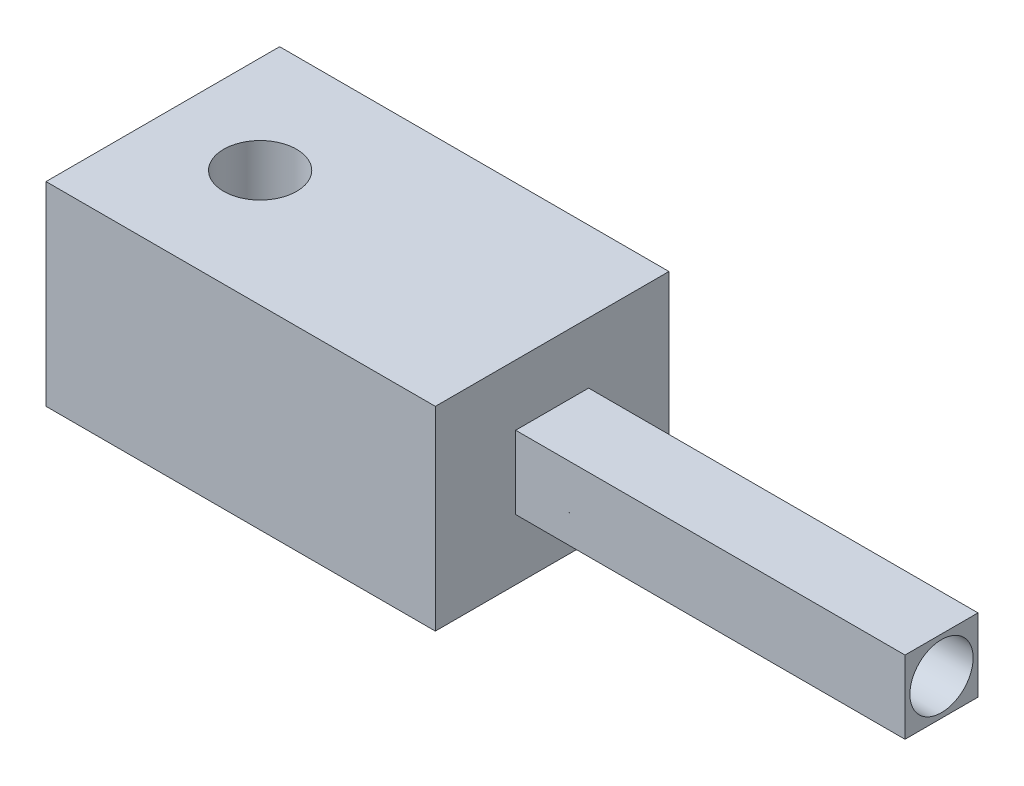
ISO-10303-21;
HEADER;
FILE_DESCRIPTION(('STEP AP214'),'2;1');
FILE_NAME('part.step','',(''),(''),'','','');
FILE_SCHEMA(('AUTOMOTIVE_DESIGN { 1 0 10303 214 1 1 1 1 }'));
ENDSEC;
DATA;
#1=APPLICATION_CONTEXT('core data for automotive mechanical design processes');
#2=APPLICATION_PROTOCOL_DEFINITION('international standard','automotive_design',2000,#1);
#3=PRODUCT_CONTEXT('',#1,'mechanical');
#4=PRODUCT('Part','Part','',(#3));
#5=PRODUCT_RELATED_PRODUCT_CATEGORY('part','',(#4));
#6=PRODUCT_DEFINITION_FORMATION('','',#4);
#7=PRODUCT_DEFINITION_CONTEXT('part definition',#1,'design');
#8=PRODUCT_DEFINITION('design','',#6,#7);
#9=PRODUCT_DEFINITION_SHAPE('','',#8);
#10=(LENGTH_UNIT() NAMED_UNIT(*) SI_UNIT(.MILLI.,.METRE.));
#11=(NAMED_UNIT(*) PLANE_ANGLE_UNIT() SI_UNIT($,.RADIAN.));
#12=(NAMED_UNIT(*) SI_UNIT($,.STERADIAN.) SOLID_ANGLE_UNIT());
#13=UNCERTAINTY_MEASURE_WITH_UNIT(LENGTH_MEASURE(1.E-05),#10,'distance_accuracy_value','');
#14=(GEOMETRIC_REPRESENTATION_CONTEXT(3) GLOBAL_UNCERTAINTY_ASSIGNED_CONTEXT((#13)) GLOBAL_UNIT_ASSIGNED_CONTEXT((#10,
#11,#12)) REPRESENTATION_CONTEXT('',''));
#15=CARTESIAN_POINT('',(0.,0.,0.));
#16=DIRECTION('',(0.,0.,1.));
#17=DIRECTION('',(1.,0.,0.));
#18=AXIS2_PLACEMENT_3D('',#15,#16,#17);
#19=CARTESIAN_POINT('',(40.,3.75,-3.75));
#20=DIRECTION('',(0.,0.,1.));
#21=DIRECTION('',(1.,0.,0.));
#22=AXIS2_PLACEMENT_3D('',#19,#20,#21);
#23=PLANE('',#22);
#24=DIRECTION('',(0.,1.,0.));
#25=VECTOR('',#24,1.);
#26=CARTESIAN_POINT('',(0.,3.75,-3.75));
#27=LINE('',#26,#25);
#28=CARTESIAN_POINT('',(0.,-3.75,-3.75));
#29=VERTEX_POINT('',#28);
#30=CARTESIAN_POINT('',(0.,3.75,-3.75));
#31=VERTEX_POINT('',#30);
#32=EDGE_CURVE('E132',#29,#31,#27,.T.);
#33=ORIENTED_EDGE('',*,*,#32,.T.);
#34=DIRECTION('',(-1.,0.,0.));
#35=VECTOR('',#34,1.);
#36=CARTESIAN_POINT('',(40.,3.75,-3.75));
#37=LINE('',#36,#35);
#38=CARTESIAN_POINT('',(40.,3.75,-3.75));
#39=VERTEX_POINT('',#38);
#40=EDGE_CURVE('E11',#39,#31,#37,.T.);
#41=ORIENTED_EDGE('',*,*,#40,.F.);
#42=DIRECTION('',(0.,1.,0.));
#43=VECTOR('',#42,1.);
#44=CARTESIAN_POINT('',(40.,3.75,-3.75));
#45=LINE('',#44,#43);
#46=CARTESIAN_POINT('',(40.,-3.75,-3.75));
#47=VERTEX_POINT('',#46);
#48=EDGE_CURVE('E143',#47,#39,#45,.T.);
#49=ORIENTED_EDGE('',*,*,#48,.F.);
#50=DIRECTION('',(-1.,0.,0.));
#51=VECTOR('',#50,1.);
#52=CARTESIAN_POINT('',(40.,-3.75,-3.75));
#53=LINE('',#52,#51);
#54=EDGE_CURVE('E154',#47,#29,#53,.T.);
#55=ORIENTED_EDGE('',*,*,#54,.T.);
#56=EDGE_LOOP('',(#33,#41,#49,#55));
#57=FACE_BOUND('',#56,.T.);
#58=ADVANCED_FACE('F43',(#57),#23,.F.);
#59=CARTESIAN_POINT('',(40.,3.75,3.75));
#60=DIRECTION('',(0.,-1.,0.));
#61=DIRECTION('',(0.,0.,-1.));
#62=AXIS2_PLACEMENT_3D('',#59,#60,#61);
#63=PLANE('',#62);
#64=DIRECTION('',(0.,0.,1.));
#65=VECTOR('',#64,1.);
#66=CARTESIAN_POINT('',(0.,3.75,3.75));
#67=LINE('',#66,#65);
#68=CARTESIAN_POINT('',(0.,3.75,3.75));
#69=VERTEX_POINT('',#68);
#70=EDGE_CURVE('E137',#31,#69,#67,.T.);
#71=ORIENTED_EDGE('',*,*,#70,.T.);
#72=DIRECTION('',(-1.,0.,0.));
#73=VECTOR('',#72,1.);
#74=CARTESIAN_POINT('',(40.,3.75,3.75));
#75=LINE('',#74,#73);
#76=CARTESIAN_POINT('',(40.,3.75,3.75));
#77=VERTEX_POINT('',#76);
#78=EDGE_CURVE('E52',#77,#69,#75,.T.);
#79=ORIENTED_EDGE('',*,*,#78,.F.);
#80=DIRECTION('',(0.,0.,1.));
#81=VECTOR('',#80,1.);
#82=CARTESIAN_POINT('',(40.,3.75,3.75));
#83=LINE('',#82,#81);
#84=EDGE_CURVE('E146',#39,#77,#83,.T.);
#85=ORIENTED_EDGE('',*,*,#84,.F.);
#86=ORIENTED_EDGE('',*,*,#40,.T.);
#87=EDGE_LOOP('',(#71,#79,#85,#86));
#88=FACE_BOUND('',#87,.T.);
#89=ADVANCED_FACE('F181',(#88),#63,.F.);
#90=CARTESIAN_POINT('',(40.,3.75,3.75));
#91=DIRECTION('',(0.,0.,-1.));
#92=DIRECTION('',(0.,1.,0.));
#93=AXIS2_PLACEMENT_3D('',#90,#91,#92);
#94=PLANE('',#93);
#95=DIRECTION('',(0.,-1.,0.));
#96=VECTOR('',#95,1.);
#97=CARTESIAN_POINT('',(0.,3.75,3.75));
#98=LINE('',#97,#96);
#99=CARTESIAN_POINT('',(0.,-3.75,3.75));
#100=VERTEX_POINT('',#99);
#101=EDGE_CURVE('E159',#69,#100,#98,.T.);
#102=ORIENTED_EDGE('',*,*,#101,.T.);
#103=DIRECTION('',(-1.,0.,0.));
#104=VECTOR('',#103,1.);
#105=CARTESIAN_POINT('',(40.,-3.75,3.75));
#106=LINE('',#105,#104);
#107=CARTESIAN_POINT('',(40.,-3.75,3.75));
#108=VERTEX_POINT('',#107);
#109=EDGE_CURVE('E169',#108,#100,#106,.T.);
#110=ORIENTED_EDGE('',*,*,#109,.F.);
#111=DIRECTION('',(0.,-1.,0.));
#112=VECTOR('',#111,1.);
#113=CARTESIAN_POINT('',(40.,3.75,3.75));
#114=LINE('',#113,#112);
#115=EDGE_CURVE('E150',#77,#108,#114,.T.);
#116=ORIENTED_EDGE('',*,*,#115,.F.);
#117=ORIENTED_EDGE('',*,*,#78,.T.);
#118=EDGE_LOOP('',(#102,#110,#116,#117));
#119=FACE_BOUND('',#118,.T.);
#120=ADVANCED_FACE('F177',(#119),#94,.F.);
#121=CARTESIAN_POINT('',(40.,-3.75,3.75));
#122=DIRECTION('',(0.,1.,0.));
#123=DIRECTION('',(0.,0.,1.));
#124=AXIS2_PLACEMENT_3D('',#121,#122,#123);
#125=PLANE('',#124);
#126=DIRECTION('',(0.,0.,-1.));
#127=VECTOR('',#126,1.);
#128=CARTESIAN_POINT('',(0.,-3.75,3.75));
#129=LINE('',#128,#127);
#130=EDGE_CURVE('E147',#100,#29,#129,.T.);
#131=ORIENTED_EDGE('',*,*,#130,.T.);
#132=ORIENTED_EDGE('',*,*,#54,.F.);
#133=DIRECTION('',(0.,0.,-1.));
#134=VECTOR('',#133,1.);
#135=CARTESIAN_POINT('',(40.,-3.75,3.75));
#136=LINE('',#135,#134);
#137=EDGE_CURVE('E59',#108,#47,#136,.T.);
#138=ORIENTED_EDGE('',*,*,#137,.F.);
#139=ORIENTED_EDGE('',*,*,#109,.T.);
#140=EDGE_LOOP('',(#131,#132,#138,#139));
#141=FACE_BOUND('',#140,.T.);
#142=ADVANCED_FACE('F187',(#141),#125,.F.);
#143=CARTESIAN_POINT('',(40.,0.,0.));
#144=DIRECTION('',(1.,0.,0.));
#145=DIRECTION('',(0.,0.,-1.));
#146=AXIS2_PLACEMENT_3D('',#143,#144,#145);
#147=PLANE('',#146);
#148=CARTESIAN_POINT('',(40.,0.,0.));
#149=DIRECTION('',(1.,0.,0.));
#150=DIRECTION('',(0.,0.,-1.));
#151=AXIS2_PLACEMENT_3D('',#148,#149,#150);
#152=CIRCLE('',#151,3.25);
#153=CARTESIAN_POINT('',(40.,0.,-3.25));
#154=VERTEX_POINT('',#153);
#155=EDGE_CURVE('E344',#154,#154,#152,.T.);
#156=ORIENTED_EDGE('',*,*,#155,.F.);
#157=EDGE_LOOP('',(#156));
#158=FACE_BOUND('',#157,.T.);
#159=ORIENTED_EDGE('',*,*,#48,.T.);
#160=ORIENTED_EDGE('',*,*,#84,.T.);
#161=ORIENTED_EDGE('',*,*,#115,.T.);
#162=ORIENTED_EDGE('',*,*,#137,.T.);
#163=EDGE_LOOP('',(#159,#160,#161,#162));
#164=FACE_BOUND('',#163,.T.);
#165=ADVANCED_FACE('F190',(#158,#164),#147,.T.);
#166=CARTESIAN_POINT('',(-40.,10.,12.));
#167=DIRECTION('',(0.,0.,-1.));
#168=DIRECTION('',(-1.,0.,0.));
#169=AXIS2_PLACEMENT_3D('',#166,#167,#168);
#170=PLANE('',#169);
#171=DIRECTION('',(0.,1.,0.));
#172=VECTOR('',#171,1.);
#173=CARTESIAN_POINT('',(0.,10.,12.));
#174=LINE('',#173,#172);
#175=CARTESIAN_POINT('',(0.,-10.,12.));
#176=VERTEX_POINT('',#175);
#177=CARTESIAN_POINT('',(0.,10.,12.));
#178=VERTEX_POINT('',#177);
#179=EDGE_CURVE('E130',#176,#178,#174,.T.);
#180=ORIENTED_EDGE('',*,*,#179,.T.);
#181=DIRECTION('',(1.,0.,0.));
#182=VECTOR('',#181,1.);
#183=CARTESIAN_POINT('',(-40.,10.,12.));
#184=LINE('',#183,#182);
#185=CARTESIAN_POINT('',(-40.,10.,12.));
#186=VERTEX_POINT('',#185);
#187=EDGE_CURVE('E108',#186,#178,#184,.T.);
#188=ORIENTED_EDGE('',*,*,#187,.F.);
#189=DIRECTION('',(0.,1.,0.));
#190=VECTOR('',#189,1.);
#191=CARTESIAN_POINT('',(-40.,10.,12.));
#192=LINE('',#191,#190);
#193=CARTESIAN_POINT('',(-40.,-10.,12.));
#194=VERTEX_POINT('',#193);
#195=EDGE_CURVE('E116',#194,#186,#192,.T.);
#196=ORIENTED_EDGE('',*,*,#195,.F.);
#197=DIRECTION('',(1.,0.,0.));
#198=VECTOR('',#197,1.);
#199=CARTESIAN_POINT('',(-40.,-10.,12.));
#200=LINE('',#199,#198);
#201=EDGE_CURVE('E365',#194,#176,#200,.T.);
#202=ORIENTED_EDGE('',*,*,#201,.T.);
#203=EDGE_LOOP('',(#180,#188,#196,#202));
#204=FACE_BOUND('',#203,.T.);
#205=ADVANCED_FACE('F128',(#204),#170,.F.);
#206=CARTESIAN_POINT('',(-40.,10.,-12.));
#207=DIRECTION('',(0.,-1.,0.));
#208=DIRECTION('',(0.,0.,-1.));
#209=AXIS2_PLACEMENT_3D('',#206,#207,#208);
#210=PLANE('',#209);
#211=CARTESIAN_POINT('',(-30.,10.,0.));
#212=DIRECTION('',(0.,1.,0.));
#213=DIRECTION('',(0.,0.,1.));
#214=AXIS2_PLACEMENT_3D('',#211,#212,#213);
#215=CIRCLE('',#214,3.75);
#216=CARTESIAN_POINT('',(-30.,10.,3.75));
#217=VERTEX_POINT('',#216);
#218=EDGE_CURVE('E349',#217,#217,#215,.T.);
#219=ORIENTED_EDGE('',*,*,#218,.F.);
#220=EDGE_LOOP('',(#219));
#221=FACE_BOUND('',#220,.T.);
#222=DIRECTION('',(0.,0.,-1.));
#223=VECTOR('',#222,1.);
#224=CARTESIAN_POINT('',(0.,10.,-12.));
#225=LINE('',#224,#223);
#226=CARTESIAN_POINT('',(0.,10.,-12.));
#227=VERTEX_POINT('',#226);
#228=EDGE_CURVE('E368',#178,#227,#225,.T.);
#229=ORIENTED_EDGE('',*,*,#228,.T.);
#230=DIRECTION('',(1.,0.,0.));
#231=VECTOR('',#230,1.);
#232=CARTESIAN_POINT('',(-40.,10.,-12.));
#233=LINE('',#232,#231);
#234=CARTESIAN_POINT('',(-40.,10.,-12.));
#235=VERTEX_POINT('',#234);
#236=EDGE_CURVE('E111',#235,#227,#233,.T.);
#237=ORIENTED_EDGE('',*,*,#236,.F.);
#238=DIRECTION('',(0.,0.,-1.));
#239=VECTOR('',#238,1.);
#240=CARTESIAN_POINT('',(-40.,10.,-12.));
#241=LINE('',#240,#239);
#242=EDGE_CURVE('E104',#186,#235,#241,.T.);
#243=ORIENTED_EDGE('',*,*,#242,.F.);
#244=ORIENTED_EDGE('',*,*,#187,.T.);
#245=EDGE_LOOP('',(#229,#237,#243,#244));
#246=FACE_BOUND('',#245,.T.);
#247=ADVANCED_FACE('F106',(#221,#246),#210,.F.);
#248=CARTESIAN_POINT('',(-40.,10.,-12.));
#249=DIRECTION('',(0.,0.,1.));
#250=DIRECTION('',(1.,0.,0.));
#251=AXIS2_PLACEMENT_3D('',#248,#249,#250);
#252=PLANE('',#251);
#253=DIRECTION('',(0.,-1.,0.));
#254=VECTOR('',#253,1.);
#255=CARTESIAN_POINT('',(0.,10.,-12.));
#256=LINE('',#255,#254);
#257=CARTESIAN_POINT('',(0.,-10.,-12.));
#258=VERTEX_POINT('',#257);
#259=EDGE_CURVE('E371',#227,#258,#256,.T.);
#260=ORIENTED_EDGE('',*,*,#259,.T.);
#261=DIRECTION('',(1.,0.,0.));
#262=VECTOR('',#261,1.);
#263=CARTESIAN_POINT('',(-40.,-10.,-12.));
#264=LINE('',#263,#262);
#265=CARTESIAN_POINT('',(-40.,-10.,-12.));
#266=VERTEX_POINT('',#265);
#267=EDGE_CURVE('E139',#266,#258,#264,.T.);
#268=ORIENTED_EDGE('',*,*,#267,.F.);
#269=DIRECTION('',(0.,-1.,0.));
#270=VECTOR('',#269,1.);
#271=CARTESIAN_POINT('',(-40.,10.,-12.));
#272=LINE('',#271,#270);
#273=EDGE_CURVE('E115',#235,#266,#272,.T.);
#274=ORIENTED_EDGE('',*,*,#273,.F.);
#275=ORIENTED_EDGE('',*,*,#236,.T.);
#276=EDGE_LOOP('',(#260,#268,#274,#275));
#277=FACE_BOUND('',#276,.T.);
#278=ADVANCED_FACE('F231',(#277),#252,.F.);
#279=CARTESIAN_POINT('',(-40.,-10.,-12.));
#280=DIRECTION('',(0.,1.,0.));
#281=DIRECTION('',(0.,0.,1.));
#282=AXIS2_PLACEMENT_3D('',#279,#280,#281);
#283=PLANE('',#282);
#284=CARTESIAN_POINT('',(-30.,-10.,0.));
#285=DIRECTION('',(0.,1.,0.));
#286=DIRECTION('',(0.,0.,1.));
#287=AXIS2_PLACEMENT_3D('',#284,#285,#286);
#288=CIRCLE('',#287,3.75);
#289=CARTESIAN_POINT('',(-30.,-10.,3.75));
#290=VERTEX_POINT('',#289);
#291=EDGE_CURVE('E354',#290,#290,#288,.F.);
#292=ORIENTED_EDGE('',*,*,#291,.F.);
#293=EDGE_LOOP('',(#292));
#294=FACE_BOUND('',#293,.T.);
#295=DIRECTION('',(0.,0.,1.));
#296=VECTOR('',#295,1.);
#297=CARTESIAN_POINT('',(0.,-10.,-12.));
#298=LINE('',#297,#296);
#299=EDGE_CURVE('E126',#258,#176,#298,.T.);
#300=ORIENTED_EDGE('',*,*,#299,.T.);
#301=ORIENTED_EDGE('',*,*,#201,.F.);
#302=DIRECTION('',(0.,0.,1.));
#303=VECTOR('',#302,1.);
#304=CARTESIAN_POINT('',(-40.,-10.,-12.));
#305=LINE('',#304,#303);
#306=EDGE_CURVE('E121',#266,#194,#305,.T.);
#307=ORIENTED_EDGE('',*,*,#306,.F.);
#308=ORIENTED_EDGE('',*,*,#267,.T.);
#309=EDGE_LOOP('',(#300,#301,#307,#308));
#310=FACE_BOUND('',#309,.T.);
#311=ADVANCED_FACE('F236',(#294,#310),#283,.F.);
#312=CARTESIAN_POINT('',(-40.,0.,0.));
#313=DIRECTION('',(-1.,0.,0.));
#314=DIRECTION('',(0.,0.,1.));
#315=AXIS2_PLACEMENT_3D('',#312,#313,#314);
#316=PLANE('',#315);
#317=ORIENTED_EDGE('',*,*,#195,.T.);
#318=ORIENTED_EDGE('',*,*,#242,.T.);
#319=ORIENTED_EDGE('',*,*,#273,.T.);
#320=ORIENTED_EDGE('',*,*,#306,.T.);
#321=EDGE_LOOP('',(#317,#318,#319,#320));
#322=FACE_BOUND('',#321,.T.);
#323=ADVANCED_FACE('F119',(#322),#316,.T.);
#324=CARTESIAN_POINT('',(0.,0.,0.));
#325=DIRECTION('',(-1.,0.,0.));
#326=DIRECTION('',(0.,0.,1.));
#327=AXIS2_PLACEMENT_3D('',#324,#325,#326);
#328=PLANE('',#327);
#329=ORIENTED_EDGE('',*,*,#32,.F.);
#330=ORIENTED_EDGE('',*,*,#130,.F.);
#331=ORIENTED_EDGE('',*,*,#101,.F.);
#332=ORIENTED_EDGE('',*,*,#70,.F.);
#333=EDGE_LOOP('',(#329,#330,#331,#332));
#334=FACE_BOUND('',#333,.T.);
#335=ORIENTED_EDGE('',*,*,#179,.F.);
#336=ORIENTED_EDGE('',*,*,#299,.F.);
#337=ORIENTED_EDGE('',*,*,#259,.F.);
#338=ORIENTED_EDGE('',*,*,#228,.F.);
#339=EDGE_LOOP('',(#335,#336,#337,#338));
#340=FACE_BOUND('',#339,.T.);
#341=ADVANCED_FACE('F184',(#334,#340),#328,.F.);
#342=CARTESIAN_POINT('',(-30.,-20.6066017177982,0.));
#343=DIRECTION('',(0.,1.,0.));
#344=DIRECTION('',(0.,0.,1.));
#345=AXIS2_PLACEMENT_3D('',#342,#343,#344);
#346=CYLINDRICAL_SURFACE('',#345,3.75);
#347=ORIENTED_EDGE('',*,*,#291,.T.);
#348=EDGE_LOOP('',(#347));
#349=FACE_BOUND('',#348,.T.);
#350=ORIENTED_EDGE('',*,*,#218,.T.);
#351=EDGE_LOOP('',(#350));
#352=FACE_BOUND('',#351,.T.);
#353=ADVANCED_FACE('F258',(#349,#352),#346,.F.);
#354=CARTESIAN_POINT('',(0.,0.,0.));
#355=DIRECTION('',(-1.,0.,0.));
#356=DIRECTION('',(0.,0.,1.));
#357=AXIS2_PLACEMENT_3D('',#354,#355,#356);
#358=PLANE('',#357);
#359=CARTESIAN_POINT('',(0.,0.,0.));
#360=DIRECTION('',(-1.,0.,0.));
#361=DIRECTION('',(0.,0.,1.));
#362=AXIS2_PLACEMENT_3D('',#359,#360,#361);
#363=CIRCLE('',#362,3.25);
#364=CARTESIAN_POINT('',(0.,0.,3.25));
#365=VERTEX_POINT('',#364);
#366=EDGE_CURVE('E347',#365,#365,#363,.F.);
#367=ORIENTED_EDGE('',*,*,#366,.T.);
#368=EDGE_LOOP('',(#367));
#369=FACE_BOUND('',#368,.T.);
#370=ADVANCED_FACE('F283',(#369),#358,.F.);
#371=CARTESIAN_POINT('',(-9.19238815542511,0.,0.));
#372=DIRECTION('',(1.,0.,0.));
#373=DIRECTION('',(0.,0.,-1.));
#374=AXIS2_PLACEMENT_3D('',#371,#372,#373);
#375=CYLINDRICAL_SURFACE('',#374,3.25);
#376=ORIENTED_EDGE('',*,*,#155,.T.);
#377=EDGE_LOOP('',(#376));
#378=FACE_BOUND('',#377,.T.);
#379=ORIENTED_EDGE('',*,*,#366,.F.);
#380=EDGE_LOOP('',(#379));
#381=FACE_BOUND('',#380,.T.);
#382=ADVANCED_FACE('F299',(#378,#381),#375,.F.);
#383=CLOSED_SHELL('',(#58,#89,#120,#142,#165,#205,#247,#278,#311,#323,#341,#353,#370,#382));
#384=MANIFOLD_SOLID_BREP('B2',#383);
#385=ADVANCED_BREP_SHAPE_REPRESENTATION('',(#18,#384),#14);
#386=SHAPE_DEFINITION_REPRESENTATION(#9,#385);
ENDSEC;
END-ISO-10303-21;
